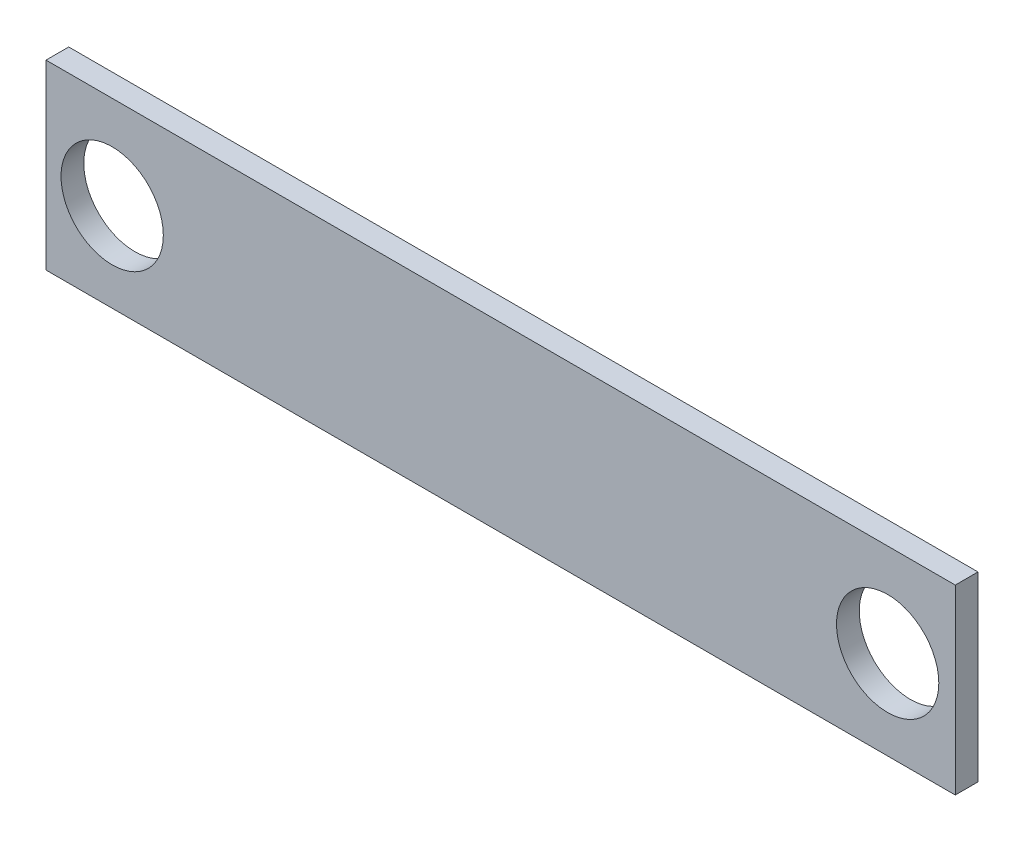
ISO-10303-21;
HEADER;
FILE_DESCRIPTION(('STEP AP214'),'2;1');
FILE_NAME('part.step','',(''),(''),'','','');
FILE_SCHEMA(('AUTOMOTIVE_DESIGN { 1 0 10303 214 1 1 1 1 }'));
ENDSEC;
DATA;
#1=APPLICATION_CONTEXT('core data for automotive mechanical design processes');
#2=APPLICATION_PROTOCOL_DEFINITION('international standard','automotive_design',2000,#1);
#3=PRODUCT_CONTEXT('',#1,'mechanical');
#4=PRODUCT('Part','Part','',(#3));
#5=PRODUCT_RELATED_PRODUCT_CATEGORY('part','',(#4));
#6=PRODUCT_DEFINITION_FORMATION('','',#4);
#7=PRODUCT_DEFINITION_CONTEXT('part definition',#1,'design');
#8=PRODUCT_DEFINITION('design','',#6,#7);
#9=PRODUCT_DEFINITION_SHAPE('','',#8);
#10=(LENGTH_UNIT() NAMED_UNIT(*) SI_UNIT(.MILLI.,.METRE.));
#11=(NAMED_UNIT(*) PLANE_ANGLE_UNIT() SI_UNIT($,.RADIAN.));
#12=(NAMED_UNIT(*) SI_UNIT($,.STERADIAN.) SOLID_ANGLE_UNIT());
#13=UNCERTAINTY_MEASURE_WITH_UNIT(LENGTH_MEASURE(1.E-05),#10,'distance_accuracy_value','');
#14=(GEOMETRIC_REPRESENTATION_CONTEXT(3) GLOBAL_UNCERTAINTY_ASSIGNED_CONTEXT((#13)) GLOBAL_UNIT_ASSIGNED_CONTEXT((#10,
#11,#12)) REPRESENTATION_CONTEXT('',''));
#15=CARTESIAN_POINT('',(0.,0.,0.));
#16=DIRECTION('',(0.,0.,1.));
#17=DIRECTION('',(1.,0.,0.));
#18=AXIS2_PLACEMENT_3D('',#15,#16,#17);
#19=CARTESIAN_POINT('',(-130.684873838518,49.6319397993311,6.35));
#20=DIRECTION('',(1.,0.,0.));
#21=DIRECTION('',(0.,0.,-1.));
#22=AXIS2_PLACEMENT_3D('',#19,#20,#21);
#23=PLANE('',#22);
#24=DIRECTION('',(0.,-1.,0.));
#25=VECTOR('',#24,1.);
#26=CARTESIAN_POINT('',(-130.684873838518,49.6319397993311,0.));
#27=LINE('',#26,#25);
#28=CARTESIAN_POINT('',(-130.684873838518,49.6319397993311,0.));
#29=VERTEX_POINT('',#28);
#30=CARTESIAN_POINT('',(-130.684873838518,-1.1680602006689,0.));
#31=VERTEX_POINT('',#30);
#32=EDGE_CURVE('E107',#29,#31,#27,.T.);
#33=ORIENTED_EDGE('',*,*,#32,.T.);
#34=DIRECTION('',(0.,0.,-1.));
#35=VECTOR('',#34,1.);
#36=CARTESIAN_POINT('',(-130.684873838518,-1.1680602006689,6.35));
#37=LINE('',#36,#35);
#38=CARTESIAN_POINT('',(-130.684873838518,-1.1680602006689,6.35));
#39=VERTEX_POINT('',#38);
#40=EDGE_CURVE('E11',#39,#31,#37,.T.);
#41=ORIENTED_EDGE('',*,*,#40,.F.);
#42=DIRECTION('',(0.,-1.,0.));
#43=VECTOR('',#42,1.);
#44=CARTESIAN_POINT('',(-130.684873838518,49.6319397993311,6.35));
#45=LINE('',#44,#43);
#46=CARTESIAN_POINT('',(-130.684873838518,49.6319397993311,6.35));
#47=VERTEX_POINT('',#46);
#48=EDGE_CURVE('E91',#47,#39,#45,.T.);
#49=ORIENTED_EDGE('',*,*,#48,.F.);
#50=DIRECTION('',(0.,0.,-1.));
#51=VECTOR('',#50,1.);
#52=CARTESIAN_POINT('',(-130.684873838518,49.6319397993311,6.35));
#53=LINE('',#52,#51);
#54=EDGE_CURVE('E103',#47,#29,#53,.T.);
#55=ORIENTED_EDGE('',*,*,#54,.T.);
#56=EDGE_LOOP('',(#33,#41,#49,#55));
#57=FACE_BOUND('',#56,.T.);
#58=ADVANCED_FACE('F39',(#57),#23,.F.);
#59=CARTESIAN_POINT('',(-130.684873838518,-1.1680602006689,6.35));
#60=DIRECTION('',(0.,1.,0.));
#61=DIRECTION('',(0.,0.,1.));
#62=AXIS2_PLACEMENT_3D('',#59,#60,#61);
#63=PLANE('',#62);
#64=DIRECTION('',(1.,0.,0.));
#65=VECTOR('',#64,1.);
#66=CARTESIAN_POINT('',(-130.684873838518,-1.1680602006689,0.));
#67=LINE('',#66,#65);
#68=CARTESIAN_POINT('',(123.315126161482,-1.1680602006689,0.));
#69=VERTEX_POINT('',#68);
#70=EDGE_CURVE('E96',#31,#69,#67,.T.);
#71=ORIENTED_EDGE('',*,*,#70,.T.);
#72=DIRECTION('',(0.,0.,-1.));
#73=VECTOR('',#72,1.);
#74=CARTESIAN_POINT('',(123.315126161482,-1.1680602006689,6.35));
#75=LINE('',#74,#73);
#76=CARTESIAN_POINT('',(123.315126161482,-1.1680602006689,6.35));
#77=VERTEX_POINT('',#76);
#78=EDGE_CURVE('E48',#77,#69,#75,.T.);
#79=ORIENTED_EDGE('',*,*,#78,.F.);
#80=DIRECTION('',(1.,0.,0.));
#81=VECTOR('',#80,1.);
#82=CARTESIAN_POINT('',(-130.684873838518,-1.1680602006689,6.35));
#83=LINE('',#82,#81);
#84=EDGE_CURVE('E86',#39,#77,#83,.T.);
#85=ORIENTED_EDGE('',*,*,#84,.F.);
#86=ORIENTED_EDGE('',*,*,#40,.T.);
#87=EDGE_LOOP('',(#71,#79,#85,#86));
#88=FACE_BOUND('',#87,.T.);
#89=ADVANCED_FACE('F95',(#88),#63,.F.);
#90=CARTESIAN_POINT('',(123.315126161482,49.6319397993311,6.35));
#91=DIRECTION('',(-1.,0.,0.));
#92=DIRECTION('',(0.,-1.,0.));
#93=AXIS2_PLACEMENT_3D('',#90,#91,#92);
#94=PLANE('',#93);
#95=DIRECTION('',(0.,1.,0.));
#96=VECTOR('',#95,1.);
#97=CARTESIAN_POINT('',(123.315126161482,49.6319397993311,0.));
#98=LINE('',#97,#96);
#99=CARTESIAN_POINT('',(123.315126161482,49.6319397993311,0.));
#100=VERTEX_POINT('',#99);
#101=EDGE_CURVE('E73',#69,#100,#98,.T.);
#102=ORIENTED_EDGE('',*,*,#101,.T.);
#103=DIRECTION('',(0.,0.,-1.));
#104=VECTOR('',#103,1.);
#105=CARTESIAN_POINT('',(123.315126161482,49.6319397993311,6.35));
#106=LINE('',#105,#104);
#107=CARTESIAN_POINT('',(123.315126161482,49.6319397993311,6.35));
#108=VERTEX_POINT('',#107);
#109=EDGE_CURVE('E98',#108,#100,#106,.T.);
#110=ORIENTED_EDGE('',*,*,#109,.F.);
#111=DIRECTION('',(0.,1.,0.));
#112=VECTOR('',#111,1.);
#113=CARTESIAN_POINT('',(123.315126161482,49.6319397993311,6.35));
#114=LINE('',#113,#112);
#115=EDGE_CURVE('E89',#77,#108,#114,.T.);
#116=ORIENTED_EDGE('',*,*,#115,.F.);
#117=ORIENTED_EDGE('',*,*,#78,.T.);
#118=EDGE_LOOP('',(#102,#110,#116,#117));
#119=FACE_BOUND('',#118,.T.);
#120=ADVANCED_FACE('F99',(#119),#94,.F.);
#121=CARTESIAN_POINT('',(-130.684873838518,49.6319397993311,6.35));
#122=DIRECTION('',(0.,-1.,0.));
#123=DIRECTION('',(0.,0.,-1.));
#124=AXIS2_PLACEMENT_3D('',#121,#122,#123);
#125=PLANE('',#124);
#126=DIRECTION('',(-1.,0.,0.));
#127=VECTOR('',#126,1.);
#128=CARTESIAN_POINT('',(-130.684873838518,49.6319397993311,0.));
#129=LINE('',#128,#127);
#130=EDGE_CURVE('E79',#100,#29,#129,.T.);
#131=ORIENTED_EDGE('',*,*,#130,.T.);
#132=ORIENTED_EDGE('',*,*,#54,.F.);
#133=DIRECTION('',(-1.,0.,0.));
#134=VECTOR('',#133,1.);
#135=CARTESIAN_POINT('',(-130.684873838518,49.6319397993311,6.35));
#136=LINE('',#135,#134);
#137=EDGE_CURVE('E56',#108,#47,#136,.T.);
#138=ORIENTED_EDGE('',*,*,#137,.F.);
#139=ORIENTED_EDGE('',*,*,#109,.T.);
#140=EDGE_LOOP('',(#131,#132,#138,#139));
#141=FACE_BOUND('',#140,.T.);
#142=ADVANCED_FACE('F121',(#141),#125,.F.);
#143=CARTESIAN_POINT('',(0.,0.,6.35));
#144=DIRECTION('',(0.,0.,1.));
#145=DIRECTION('',(1.,0.,0.));
#146=AXIS2_PLACEMENT_3D('',#143,#144,#145);
#147=PLANE('',#146);
#148=CARTESIAN_POINT('',(-112.202147571237,23.6244456796229,6.35));
#149=DIRECTION('',(0.,0.,1.));
#150=DIRECTION('',(1.,0.,0.));
#151=AXIS2_PLACEMENT_3D('',#148,#149,#150);
#152=CIRCLE('',#151,14.2875);
#153=CARTESIAN_POINT('',(-97.9146475712369,23.6244456796229,6.35));
#154=VERTEX_POINT('',#153);
#155=EDGE_CURVE('E136',#154,#154,#152,.T.);
#156=ORIENTED_EDGE('',*,*,#155,.F.);
#157=EDGE_LOOP('',(#156));
#158=FACE_BOUND('',#157,.T.);
#159=CARTESIAN_POINT('',(104.426951424113,23.6244456796229,6.35));
#160=DIRECTION('',(0.,0.,1.));
#161=DIRECTION('',(1.,0.,0.));
#162=AXIS2_PLACEMENT_3D('',#159,#160,#161);
#163=CIRCLE('',#162,14.2875);
#164=CARTESIAN_POINT('',(118.714451424113,23.6244456796229,6.35));
#165=VERTEX_POINT('',#164);
#166=EDGE_CURVE('E128',#165,#165,#163,.T.);
#167=ORIENTED_EDGE('',*,*,#166,.F.);
#168=EDGE_LOOP('',(#167));
#169=FACE_BOUND('',#168,.T.);
#170=ORIENTED_EDGE('',*,*,#48,.T.);
#171=ORIENTED_EDGE('',*,*,#84,.T.);
#172=ORIENTED_EDGE('',*,*,#115,.T.);
#173=ORIENTED_EDGE('',*,*,#137,.T.);
#174=EDGE_LOOP('',(#170,#171,#172,#173));
#175=FACE_BOUND('',#174,.T.);
#176=ADVANCED_FACE('F87',(#158,#169,#175),#147,.T.);
#177=CARTESIAN_POINT('',(0.,0.,0.));
#178=DIRECTION('',(0.,0.,1.));
#179=DIRECTION('',(1.,0.,0.));
#180=AXIS2_PLACEMENT_3D('',#177,#178,#179);
#181=PLANE('',#180);
#182=CARTESIAN_POINT('',(-112.202147571237,23.6244456796229,0.));
#183=DIRECTION('',(0.,0.,1.));
#184=DIRECTION('',(1.,0.,0.));
#185=AXIS2_PLACEMENT_3D('',#182,#183,#184);
#186=CIRCLE('',#185,14.2875);
#187=CARTESIAN_POINT('',(-97.9146475712369,23.6244456796229,0.));
#188=VERTEX_POINT('',#187);
#189=EDGE_CURVE('E111',#188,#188,#186,.T.);
#190=ORIENTED_EDGE('',*,*,#189,.T.);
#191=EDGE_LOOP('',(#190));
#192=FACE_BOUND('',#191,.T.);
#193=CARTESIAN_POINT('',(104.426951424113,23.6244456796229,0.));
#194=DIRECTION('',(0.,0.,1.));
#195=DIRECTION('',(1.,0.,0.));
#196=AXIS2_PLACEMENT_3D('',#193,#194,#195);
#197=CIRCLE('',#196,14.2875);
#198=CARTESIAN_POINT('',(118.714451424113,23.6244456796229,0.));
#199=VERTEX_POINT('',#198);
#200=EDGE_CURVE('E132',#199,#199,#197,.T.);
#201=ORIENTED_EDGE('',*,*,#200,.T.);
#202=EDGE_LOOP('',(#201));
#203=FACE_BOUND('',#202,.T.);
#204=ORIENTED_EDGE('',*,*,#32,.F.);
#205=ORIENTED_EDGE('',*,*,#130,.F.);
#206=ORIENTED_EDGE('',*,*,#101,.F.);
#207=ORIENTED_EDGE('',*,*,#70,.F.);
#208=EDGE_LOOP('',(#204,#205,#206,#207));
#209=FACE_BOUND('',#208,.T.);
#210=ADVANCED_FACE('F124',(#192,#203,#209),#181,.F.);
#211=CARTESIAN_POINT('',(104.426951424113,23.6244456796229,0.));
#212=DIRECTION('',(0.,0.,1.));
#213=DIRECTION('',(1.,0.,0.));
#214=AXIS2_PLACEMENT_3D('',#211,#212,#213);
#215=CYLINDRICAL_SURFACE('',#214,14.2875);
#216=ORIENTED_EDGE('',*,*,#200,.F.);
#217=EDGE_LOOP('',(#216));
#218=FACE_BOUND('',#217,.T.);
#219=ORIENTED_EDGE('',*,*,#166,.T.);
#220=EDGE_LOOP('',(#219));
#221=FACE_BOUND('',#220,.T.);
#222=ADVANCED_FACE('F149',(#218,#221),#215,.F.);
#223=CARTESIAN_POINT('',(-112.202147571237,23.6244456796229,0.));
#224=DIRECTION('',(0.,0.,1.));
#225=DIRECTION('',(1.,0.,0.));
#226=AXIS2_PLACEMENT_3D('',#223,#224,#225);
#227=CYLINDRICAL_SURFACE('',#226,14.2875);
#228=ORIENTED_EDGE('',*,*,#189,.F.);
#229=EDGE_LOOP('',(#228));
#230=FACE_BOUND('',#229,.T.);
#231=ORIENTED_EDGE('',*,*,#155,.T.);
#232=EDGE_LOOP('',(#231));
#233=FACE_BOUND('',#232,.T.);
#234=ADVANCED_FACE('F146',(#230,#233),#227,.F.);
#235=CLOSED_SHELL('',(#58,#89,#120,#142,#176,#210,#222,#234));
#236=MANIFOLD_SOLID_BREP('B2',#235);
#237=ADVANCED_BREP_SHAPE_REPRESENTATION('',(#18,#236),#14);
#238=SHAPE_DEFINITION_REPRESENTATION(#9,#237);
ENDSEC;
END-ISO-10303-21;
